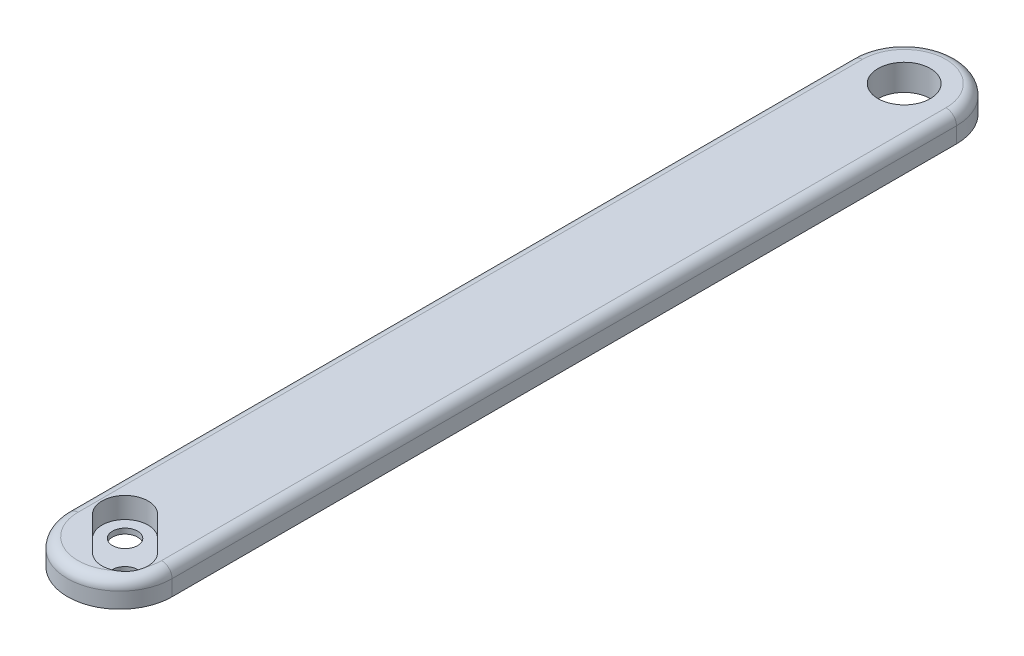
ISO-10303-21;
HEADER;
FILE_DESCRIPTION(('STEP AP214'),'2;1');
FILE_NAME('part.step','',(''),(''),'','','');
FILE_SCHEMA(('AUTOMOTIVE_DESIGN { 1 0 10303 214 1 1 1 1 }'));
ENDSEC;
DATA;
#1=APPLICATION_CONTEXT('core data for automotive mechanical design processes');
#2=APPLICATION_PROTOCOL_DEFINITION('international standard','automotive_design',2000,#1);
#3=PRODUCT_CONTEXT('',#1,'mechanical');
#4=PRODUCT('Part','Part','',(#3));
#5=PRODUCT_RELATED_PRODUCT_CATEGORY('part','',(#4));
#6=PRODUCT_DEFINITION_FORMATION('','',#4);
#7=PRODUCT_DEFINITION_CONTEXT('part definition',#1,'design');
#8=PRODUCT_DEFINITION('design','',#6,#7);
#9=PRODUCT_DEFINITION_SHAPE('','',#8);
#10=(LENGTH_UNIT() NAMED_UNIT(*) SI_UNIT(.MILLI.,.METRE.));
#11=(NAMED_UNIT(*) PLANE_ANGLE_UNIT() SI_UNIT($,.RADIAN.));
#12=(NAMED_UNIT(*) SI_UNIT($,.STERADIAN.) SOLID_ANGLE_UNIT());
#13=UNCERTAINTY_MEASURE_WITH_UNIT(LENGTH_MEASURE(1.E-05),#10,'distance_accuracy_value','');
#14=(GEOMETRIC_REPRESENTATION_CONTEXT(3) GLOBAL_UNCERTAINTY_ASSIGNED_CONTEXT((#13)) GLOBAL_UNIT_ASSIGNED_CONTEXT((#10,
#11,#12)) REPRESENTATION_CONTEXT('',''));
#15=CARTESIAN_POINT('',(0.,0.,0.));
#16=DIRECTION('',(0.,0.,1.));
#17=DIRECTION('',(1.,0.,0.));
#18=AXIS2_PLACEMENT_3D('',#15,#16,#17);
#19=CARTESIAN_POINT('',(400000.,1.50000000002137,52.9403065089141));
#20=DIRECTION('',(0.,1.,0.));
#21=DIRECTION('',(0.,0.,1.));
#22=AXIS2_PLACEMENT_3D('',#19,#20,#21);
#23=PLANE('',#22);
#24=CARTESIAN_POINT('',(0.,1.50000000002137,-37.5));
#25=DIRECTION('',(0.,1.,0.));
#26=DIRECTION('',(0.,0.,1.));
#27=AXIS2_PLACEMENT_3D('',#24,#25,#26);
#28=CIRCLE('',#27,2.5);
#29=CARTESIAN_POINT('',(0.,1.50000000002137,-35.));
#30=VERTEX_POINT('',#29);
#31=EDGE_CURVE('E179',#30,#30,#28,.T.);
#32=ORIENTED_EDGE('',*,*,#31,.T.);
#33=EDGE_LOOP('',(#32));
#34=FACE_BOUND('',#33,.T.);
#35=DIRECTION('',(0.,0.,-1.));
#36=VECTOR('',#35,1.);
#37=CARTESIAN_POINT('',(4.99999999999545,1.50000000002137,52.9403065089141));
#38=LINE('',#37,#36);
#39=CARTESIAN_POINT('',(4.99999999999999,1.5,37.5));
#40=VERTEX_POINT('',#39);
#41=CARTESIAN_POINT('',(4.99999999999545,1.50000000002137,-37.5));
#42=VERTEX_POINT('',#41);
#43=EDGE_CURVE('E65',#40,#42,#38,.T.);
#44=ORIENTED_EDGE('',*,*,#43,.F.);
#45=CARTESIAN_POINT('',(0.,1.5,37.5));
#46=DIRECTION('',(0.,1.,0.));
#47=DIRECTION('',(0.,0.,1.));
#48=AXIS2_PLACEMENT_3D('',#45,#46,#47);
#49=CIRCLE('',#48,4.99999999999998);
#50=CARTESIAN_POINT('',(-4.99999999999998,1.5,37.5));
#51=VERTEX_POINT('',#50);
#52=EDGE_CURVE('E297',#51,#40,#49,.T.);
#53=ORIENTED_EDGE('',*,*,#52,.F.);
#54=DIRECTION('',(0.,0.,-1.));
#55=VECTOR('',#54,1.);
#56=CARTESIAN_POINT('',(-4.99999999999545,1.50000000002137,52.9403065089141));
#57=LINE('',#56,#55);
#58=CARTESIAN_POINT('',(-4.99999999999545,1.50000000002137,-37.5));
#59=VERTEX_POINT('',#58);
#60=EDGE_CURVE('E58',#51,#59,#57,.T.);
#61=ORIENTED_EDGE('',*,*,#60,.T.);
#62=CARTESIAN_POINT('',(0.,1.50000000002137,-37.5));
#63=DIRECTION('',(0.,1.,0.));
#64=DIRECTION('',(0.,0.,1.));
#65=AXIS2_PLACEMENT_3D('',#62,#63,#64);
#66=CIRCLE('',#65,4.99999999999998);
#67=EDGE_CURVE('E181',#42,#59,#66,.T.);
#68=ORIENTED_EDGE('',*,*,#67,.F.);
#69=EDGE_LOOP('',(#44,#53,#61,#68));
#70=FACE_BOUND('',#69,.T.);
#71=CARTESIAN_POINT('',(-1.59099025766973,1.5,35.4090097423302));
#72=DIRECTION('',(0.,1.,0.));
#73=DIRECTION('',(0.,0.,1.));
#74=AXIS2_PLACEMENT_3D('',#71,#72,#73);
#75=CIRCLE('',#74,1.2);
#76=CARTESIAN_POINT('',(-1.59099025766973,1.5,36.6090097423302));
#77=VERTEX_POINT('',#76);
#78=EDGE_CURVE('E51',#77,#77,#75,.F.);
#79=ORIENTED_EDGE('',*,*,#78,.F.);
#80=EDGE_LOOP('',(#79));
#81=FACE_BOUND('',#80,.T.);
#82=CARTESIAN_POINT('',(1.59099025766973,1.5,38.5909902576697));
#83=DIRECTION('',(0.,1.,0.));
#84=DIRECTION('',(0.,0.,1.));
#85=AXIS2_PLACEMENT_3D('',#82,#83,#84);
#86=CIRCLE('',#85,1.2);
#87=CARTESIAN_POINT('',(1.59099025766973,1.5,39.7909902576697));
#88=VERTEX_POINT('',#87);
#89=EDGE_CURVE('E11',#88,#88,#86,.F.);
#90=ORIENTED_EDGE('',*,*,#89,.F.);
#91=EDGE_LOOP('',(#90));
#92=FACE_BOUND('',#91,.T.);
#93=ADVANCED_FACE('F42',(#34,#70,#81,#92),#23,.F.);
#94=CARTESIAN_POINT('',(-35.6943650813896,2.,-1.80563491861055));
#95=DIRECTION('',(-0.707106781186549,0.,0.707106781186546));
#96=DIRECTION('',(0.707106781186546,0.,0.707106781186549));
#97=AXIS2_PLACEMENT_3D('',#94,#95,#96);
#98=PLANE('',#97);
#99=DIRECTION('',(0.707106781186546,0.,0.707106781186549));
#100=VECTOR('',#99,1.);
#101=CARTESIAN_POINT('',(-35.6943650813896,4.,-1.80563491861055));
#102=LINE('',#101,#100);
#103=CARTESIAN_POINT('',(-0.0353553390593218,4.,33.8533748237198));
#104=VERTEX_POINT('',#103);
#105=CARTESIAN_POINT('',(3.14662517628014,4.,37.0353553390593));
#106=VERTEX_POINT('',#105);
#107=EDGE_CURVE('E161',#104,#106,#102,.T.);
#108=ORIENTED_EDGE('',*,*,#107,.F.);
#109=DIRECTION('',(0.,1.,0.));
#110=VECTOR('',#109,1.);
#111=CARTESIAN_POINT('',(-0.0353553390593144,2.,33.8533748237198));
#112=LINE('',#111,#110);
#113=CARTESIAN_POINT('',(-0.0353553390593144,2.,33.8533748237198));
#114=VERTEX_POINT('',#113);
#115=EDGE_CURVE('E135',#114,#104,#112,.T.);
#116=ORIENTED_EDGE('',*,*,#115,.F.);
#117=DIRECTION('',(0.707106781186546,0.,0.707106781186549));
#118=VECTOR('',#117,1.);
#119=CARTESIAN_POINT('',(-35.6943650813896,2.,-1.80563491861055));
#120=LINE('',#119,#118);
#121=CARTESIAN_POINT('',(3.14662517628014,2.,37.0353553390593));
#122=VERTEX_POINT('',#121);
#123=EDGE_CURVE('E129',#114,#122,#120,.T.);
#124=ORIENTED_EDGE('',*,*,#123,.T.);
#125=DIRECTION('',(0.,1.,0.));
#126=VECTOR('',#125,1.);
#127=CARTESIAN_POINT('',(3.14662517628014,2.,37.0353553390593));
#128=LINE('',#127,#126);
#129=EDGE_CURVE('E132',#122,#106,#128,.T.);
#130=ORIENTED_EDGE('',*,*,#129,.T.);
#131=EDGE_LOOP('',(#108,#116,#124,#130));
#132=FACE_BOUND('',#131,.T.);
#133=ADVANCED_FACE('F131',(#132),#98,.T.);
#134=CARTESIAN_POINT('',(-1.59099025766973,2.,35.4090097423302));
#135=DIRECTION('',(0.,1.,0.));
#136=DIRECTION('',(0.,0.,1.));
#137=AXIS2_PLACEMENT_3D('',#134,#135,#136);
#138=CYLINDRICAL_SURFACE('',#137,2.2);
#139=CARTESIAN_POINT('',(-1.59099025766973,4.,35.4090097423302));
#140=DIRECTION('',(0.,1.,0.));
#141=DIRECTION('',(0.,0.,1.));
#142=AXIS2_PLACEMENT_3D('',#139,#140,#141);
#143=CIRCLE('',#142,2.2);
#144=CARTESIAN_POINT('',(-3.14662517628013,4.,36.9646446609407));
#145=VERTEX_POINT('',#144);
#146=EDGE_CURVE('E175',#104,#145,#143,.T.);
#147=ORIENTED_EDGE('',*,*,#146,.T.);
#148=DIRECTION('',(0.,1.,0.));
#149=VECTOR('',#148,1.);
#150=CARTESIAN_POINT('',(-3.14662517628013,2.,36.9646446609407));
#151=LINE('',#150,#149);
#152=CARTESIAN_POINT('',(-3.14662517628013,2.,36.9646446609407));
#153=VERTEX_POINT('',#152);
#154=EDGE_CURVE('E169',#153,#145,#151,.T.);
#155=ORIENTED_EDGE('',*,*,#154,.F.);
#156=CARTESIAN_POINT('',(-1.59099025766973,2.,35.4090097423302));
#157=DIRECTION('',(0.,1.,0.));
#158=DIRECTION('',(0.,0.,1.));
#159=AXIS2_PLACEMENT_3D('',#156,#157,#158);
#160=CIRCLE('',#159,2.2);
#161=EDGE_CURVE('E157',#114,#153,#160,.T.);
#162=ORIENTED_EDGE('',*,*,#161,.F.);
#163=ORIENTED_EDGE('',*,*,#115,.T.);
#164=EDGE_LOOP('',(#147,#155,#162,#163));
#165=FACE_BOUND('',#164,.T.);
#166=ADVANCED_FACE('F234',(#165),#138,.F.);
#167=CARTESIAN_POINT('',(-38.8056349186104,2.,1.30563491861026));
#168=DIRECTION('',(0.707106781186549,0.,-0.707106781186546));
#169=DIRECTION('',(-0.707106781186546,0.,-0.707106781186549));
#170=AXIS2_PLACEMENT_3D('',#167,#168,#169);
#171=PLANE('',#170);
#172=DIRECTION('',(-0.707106781186546,0.,-0.707106781186549));
#173=VECTOR('',#172,1.);
#174=CARTESIAN_POINT('',(-38.8056349186104,4.,1.30563491861026));
#175=LINE('',#174,#173);
#176=CARTESIAN_POINT('',(0.0353553390593161,4.,40.1466251762801));
#177=VERTEX_POINT('',#176);
#178=EDGE_CURVE('E141',#177,#145,#175,.T.);
#179=ORIENTED_EDGE('',*,*,#178,.F.);
#180=DIRECTION('',(0.,1.,0.));
#181=VECTOR('',#180,1.);
#182=CARTESIAN_POINT('',(0.0353553390593161,2.,40.1466251762801));
#183=LINE('',#182,#181);
#184=CARTESIAN_POINT('',(0.0353553390593161,2.,40.1466251762801));
#185=VERTEX_POINT('',#184);
#186=EDGE_CURVE('E150',#185,#177,#183,.T.);
#187=ORIENTED_EDGE('',*,*,#186,.F.);
#188=DIRECTION('',(-0.707106781186546,0.,-0.707106781186549));
#189=VECTOR('',#188,1.);
#190=CARTESIAN_POINT('',(-38.8056349186104,2.,1.30563491861026));
#191=LINE('',#190,#189);
#192=EDGE_CURVE('E155',#185,#153,#191,.T.);
#193=ORIENTED_EDGE('',*,*,#192,.T.);
#194=ORIENTED_EDGE('',*,*,#154,.T.);
#195=EDGE_LOOP('',(#179,#187,#193,#194));
#196=FACE_BOUND('',#195,.T.);
#197=ADVANCED_FACE('F230',(#196),#171,.T.);
#198=CARTESIAN_POINT('',(1.59099025766973,2.,38.5909902576697));
#199=DIRECTION('',(0.,1.,0.));
#200=DIRECTION('',(0.,0.,1.));
#201=AXIS2_PLACEMENT_3D('',#198,#199,#200);
#202=CYLINDRICAL_SURFACE('',#201,2.2);
#203=CARTESIAN_POINT('',(1.59099025766973,4.,38.5909902576697));
#204=DIRECTION('',(0.,1.,0.));
#205=DIRECTION('',(0.,0.,1.));
#206=AXIS2_PLACEMENT_3D('',#203,#204,#205);
#207=CIRCLE('',#206,2.2);
#208=CARTESIAN_POINT('',(2.58169802268782,4.,40.5552962736287));
#209=VERTEX_POINT('',#208);
#210=EDGE_CURVE('E164',#177,#209,#207,.T.);
#211=ORIENTED_EDGE('',*,*,#210,.T.);
#212=CARTESIAN_POINT('',(2.58169802268782,4.,40.5552962736287));
#213=CARTESIAN_POINT('',(2.63689183740544,3.99999159626086,40.5274656465535));
#214=CARTESIAN_POINT('',(2.69090327050049,3.99969050898031,40.4973003692301));
#215=CARTESIAN_POINT('',(2.79619330700551,3.99874624990308,40.4325381931477));
#216=CARTESIAN_POINT('',(2.84747207442742,3.99810309866225,40.3979415607794));
#217=CARTESIAN_POINT('',(2.94686026907065,3.99671898152754,40.3246064138783));
#218=CARTESIAN_POINT('',(2.99497436930376,3.99597816494018,40.2858742384285));
#219=CARTESIAN_POINT('',(3.08776875404367,3.99457563468766,40.2045162109842));
#220=CARTESIAN_POINT('',(3.13244908076547,3.99391392004995,40.1618904068722));
#221=CARTESIAN_POINT('',(3.26099220874909,3.99226245439816,40.0284644930363));
#222=CARTESIAN_POINT('',(3.33928322705264,3.99160784773623,39.9321705310243));
#223=CARTESIAN_POINT('',(3.47856949250349,3.99165080628025,39.7277997572248));
#224=CARTESIAN_POINT('',(3.53956541317033,3.99234831882259,39.6197234045035));
#225=CARTESIAN_POINT('',(3.61631302097894,3.99403229212766,39.4522466884963));
#226=CARTESIAN_POINT('',(3.63929494649869,3.99469119190382,39.396056907531));
#227=CARTESIAN_POINT('',(3.68054491834109,3.99607743250649,39.2819583680319));
#228=CARTESIAN_POINT('',(3.69881298820422,3.99680477299121,39.2240496180839));
#229=CARTESIAN_POINT('',(3.73052034716171,3.99815807772737,39.1068408280111));
#230=CARTESIAN_POINT('',(3.74395289067171,3.99878389969694,39.0475389663114));
#231=CARTESIAN_POINT('',(3.76587132181636,3.99970095443944,38.9280213710737));
#232=CARTESIAN_POINT('',(3.77435685141511,3.9999921629965,38.8678055717138));
#233=CARTESIAN_POINT('',(3.78032670887704,4.,38.80733697804));
#234=B_SPLINE_CURVE_WITH_KNOTS('',3,(#212,#213,#214,#215,#216,#217,#218,#219,#220,#221,#222,
#223,#224,#225,#226,#227,#228,#229,#230,#231,#232,#233),.UNSPECIFIED.,.F.,.F.,(4,2,2,2,2,2,2,2,
2,2,4),(0.,0.18537747485937,0.370743810981603,0.555829983891321,0.740913880977977,
1.11135401447838,1.48177972002065,1.66374251795893,1.84570440717749,2.0279191594073,
2.21014709763721),.UNSPECIFIED.);
#235=CARTESIAN_POINT('',(3.78032670887704,4.,38.80733697804));
#236=VERTEX_POINT('',#235);
#237=EDGE_CURVE('E216',#209,#236,#234,.T.);
#238=ORIENTED_EDGE('',*,*,#237,.T.);
#239=EDGE_CURVE('E148',#236,#106,#207,.T.);
#240=ORIENTED_EDGE('',*,*,#239,.T.);
#241=ORIENTED_EDGE('',*,*,#129,.F.);
#242=CARTESIAN_POINT('',(1.59099025766973,2.,38.5909902576697));
#243=DIRECTION('',(0.,1.,0.));
#244=DIRECTION('',(0.,0.,1.));
#245=AXIS2_PLACEMENT_3D('',#242,#243,#244);
#246=CIRCLE('',#245,2.2);
#247=EDGE_CURVE('E140',#185,#122,#246,.T.);
#248=ORIENTED_EDGE('',*,*,#247,.F.);
#249=ORIENTED_EDGE('',*,*,#186,.T.);
#250=EDGE_LOOP('',(#211,#238,#240,#241,#248,#249));
#251=FACE_BOUND('',#250,.T.);
#252=ADVANCED_FACE('F146',(#251),#202,.F.);
#253=CARTESIAN_POINT('',(0.,4.,-37.5));
#254=DIRECTION('',(0.,1.,0.));
#255=DIRECTION('',(0.,0.,1.));
#256=AXIS2_PLACEMENT_3D('',#253,#254,#255);
#257=PLANE('',#256);
#258=ORIENTED_EDGE('',*,*,#239,.F.);
#259=CARTESIAN_POINT('',(0.,4.,37.5));
#260=DIRECTION('',(0.,1.,0.));
#261=DIRECTION('',(0.,0.,1.));
#262=AXIS2_PLACEMENT_3D('',#259,#260,#261);
#263=CIRCLE('',#262,3.99999999999998);
#264=CARTESIAN_POINT('',(3.99999999999999,4.,37.5));
#265=VERTEX_POINT('',#264);
#266=EDGE_CURVE('E209',#236,#265,#263,.T.);
#267=ORIENTED_EDGE('',*,*,#266,.T.);
#268=DIRECTION('',(0.,0.,-1.));
#269=VECTOR('',#268,1.);
#270=CARTESIAN_POINT('',(3.99999999999997,4.,-37.5));
#271=LINE('',#270,#269);
#272=CARTESIAN_POINT('',(3.99999999999997,4.,-37.5));
#273=VERTEX_POINT('',#272);
#274=EDGE_CURVE('E207',#265,#273,#271,.T.);
#275=ORIENTED_EDGE('',*,*,#274,.T.);
#276=CARTESIAN_POINT('',(0.,4.,-37.5));
#277=DIRECTION('',(0.,1.,0.));
#278=DIRECTION('',(0.,0.,1.));
#279=AXIS2_PLACEMENT_3D('',#276,#277,#278);
#280=CIRCLE('',#279,3.99999999999998);
#281=CARTESIAN_POINT('',(-4.,4.,-37.5));
#282=VERTEX_POINT('',#281);
#283=EDGE_CURVE('E204',#273,#282,#280,.T.);
#284=ORIENTED_EDGE('',*,*,#283,.T.);
#285=DIRECTION('',(0.,0.,1.));
#286=VECTOR('',#285,1.);
#287=CARTESIAN_POINT('',(-3.99999999999998,4.,37.5));
#288=LINE('',#287,#286);
#289=CARTESIAN_POINT('',(-3.99999999999998,4.,37.5));
#290=VERTEX_POINT('',#289);
#291=EDGE_CURVE('E196',#282,#290,#288,.T.);
#292=ORIENTED_EDGE('',*,*,#291,.T.);
#293=CARTESIAN_POINT('',(0.,4.,37.5));
#294=DIRECTION('',(0.,1.,0.));
#295=DIRECTION('',(0.,0.,1.));
#296=AXIS2_PLACEMENT_3D('',#293,#294,#295);
#297=CIRCLE('',#296,3.99999999999998);
#298=EDGE_CURVE('E202',#290,#209,#297,.T.);
#299=ORIENTED_EDGE('',*,*,#298,.T.);
#300=ORIENTED_EDGE('',*,*,#210,.F.);
#301=ORIENTED_EDGE('',*,*,#178,.T.);
#302=ORIENTED_EDGE('',*,*,#146,.F.);
#303=ORIENTED_EDGE('',*,*,#107,.T.);
#304=EDGE_LOOP('',(#258,#267,#275,#284,#292,#299,#300,#301,#302,#303));
#305=FACE_BOUND('',#304,.T.);
#306=CARTESIAN_POINT('',(0.,4.,-37.5));
#307=DIRECTION('',(0.,1.,0.));
#308=DIRECTION('',(0.,0.,1.));
#309=AXIS2_PLACEMENT_3D('',#306,#307,#308);
#310=CIRCLE('',#309,2.5);
#311=CARTESIAN_POINT('',(0.,4.,-35.));
#312=VERTEX_POINT('',#311);
#313=EDGE_CURVE('E183',#312,#312,#310,.T.);
#314=ORIENTED_EDGE('',*,*,#313,.F.);
#315=EDGE_LOOP('',(#314));
#316=FACE_BOUND('',#315,.T.);
#317=ADVANCED_FACE('F229',(#305,#316),#257,.T.);
#318=CARTESIAN_POINT('',(0.,4.,-37.5));
#319=DIRECTION('',(0.,-1.,0.));
#320=DIRECTION('',(0.,0.,-1.));
#321=AXIS2_PLACEMENT_3D('',#318,#319,#320);
#322=CYLINDRICAL_SURFACE('',#321,2.5);
#323=ORIENTED_EDGE('',*,*,#31,.F.);
#324=EDGE_LOOP('',(#323));
#325=FACE_BOUND('',#324,.T.);
#326=ORIENTED_EDGE('',*,*,#313,.T.);
#327=EDGE_LOOP('',(#326));
#328=FACE_BOUND('',#327,.T.);
#329=ADVANCED_FACE('F246',(#325,#328),#322,.F.);
#330=CARTESIAN_POINT('',(0.,3.,37.5));
#331=DIRECTION('',(0.,1.,0.));
#332=DIRECTION('',(0.,0.,1.));
#333=AXIS2_PLACEMENT_3D('',#330,#331,#332);
#334=TOROIDAL_SURFACE('',#333,3.99999999999998,1.);
#335=CARTESIAN_POINT('',(-3.99999999999998,3.,37.5));
#336=DIRECTION('',(0.,0.,-1.));
#337=DIRECTION('',(-1.,0.,0.));
#338=AXIS2_PLACEMENT_3D('',#335,#336,#337);
#339=CIRCLE('',#338,1.);
#340=CARTESIAN_POINT('',(-4.99999999999998,3.,37.5));
#341=VERTEX_POINT('',#340);
#342=EDGE_CURVE('E290',#341,#290,#339,.T.);
#343=ORIENTED_EDGE('',*,*,#342,.F.);
#344=CARTESIAN_POINT('',(0.,3.,37.5));
#345=DIRECTION('',(0.,1.,0.));
#346=DIRECTION('',(0.,0.,1.));
#347=AXIS2_PLACEMENT_3D('',#344,#345,#346);
#348=CIRCLE('',#347,4.99999999999998);
#349=CARTESIAN_POINT('',(4.99999999999999,3.,37.5));
#350=VERTEX_POINT('',#349);
#351=EDGE_CURVE('E223',#350,#341,#348,.F.);
#352=ORIENTED_EDGE('',*,*,#351,.F.);
#353=CARTESIAN_POINT('',(3.99999999999999,3.,37.5));
#354=DIRECTION('',(0.,0.,-1.));
#355=DIRECTION('',(-1.,0.,0.));
#356=AXIS2_PLACEMENT_3D('',#353,#354,#355);
#357=CIRCLE('',#356,1.);
#358=EDGE_CURVE('E163',#265,#350,#357,.T.);
#359=ORIENTED_EDGE('',*,*,#358,.F.);
#360=ORIENTED_EDGE('',*,*,#266,.F.);
#361=ORIENTED_EDGE('',*,*,#237,.F.);
#362=ORIENTED_EDGE('',*,*,#298,.F.);
#363=EDGE_LOOP('',(#343,#352,#359,#360,#361,#362));
#364=FACE_BOUND('',#363,.T.);
#365=ADVANCED_FACE('F44',(#364),#334,.T.);
#366=CARTESIAN_POINT('',(0.,3.,-37.5));
#367=DIRECTION('',(0.,1.,0.));
#368=DIRECTION('',(0.,0.,1.));
#369=AXIS2_PLACEMENT_3D('',#366,#367,#368);
#370=TOROIDAL_SURFACE('',#369,3.99999999999998,1.);
#371=CARTESIAN_POINT('',(3.99999999999997,3.,-37.5));
#372=DIRECTION('',(0.,0.,-1.));
#373=DIRECTION('',(-1.,0.,0.));
#374=AXIS2_PLACEMENT_3D('',#371,#372,#373);
#375=CIRCLE('',#374,1.);
#376=CARTESIAN_POINT('',(4.99999999999997,3.,-37.5));
#377=VERTEX_POINT('',#376);
#378=EDGE_CURVE('E293',#273,#377,#375,.T.);
#379=ORIENTED_EDGE('',*,*,#378,.T.);
#380=CARTESIAN_POINT('',(0.,3.,-37.5));
#381=DIRECTION('',(0.,1.,0.));
#382=DIRECTION('',(0.,0.,1.));
#383=AXIS2_PLACEMENT_3D('',#380,#381,#382);
#384=CIRCLE('',#383,4.99999999999998);
#385=CARTESIAN_POINT('',(-5.,3.,-37.5));
#386=VERTEX_POINT('',#385);
#387=EDGE_CURVE('E211',#386,#377,#384,.F.);
#388=ORIENTED_EDGE('',*,*,#387,.F.);
#389=CARTESIAN_POINT('',(-4.,3.,-37.5));
#390=DIRECTION('',(0.,0.,-1.));
#391=DIRECTION('',(-1.,0.,0.));
#392=AXIS2_PLACEMENT_3D('',#389,#390,#391);
#393=CIRCLE('',#392,1.);
#394=EDGE_CURVE('E332',#386,#282,#393,.T.);
#395=ORIENTED_EDGE('',*,*,#394,.T.);
#396=ORIENTED_EDGE('',*,*,#283,.F.);
#397=EDGE_LOOP('',(#379,#388,#395,#396));
#398=FACE_BOUND('',#397,.T.);
#399=ADVANCED_FACE('F270',(#398),#370,.T.);
#400=CARTESIAN_POINT('',(3.99999999999997,3.,-37.5));
#401=DIRECTION('',(0.,0.,1.));
#402=DIRECTION('',(1.,0.,0.));
#403=AXIS2_PLACEMENT_3D('',#400,#401,#402);
#404=CYLINDRICAL_SURFACE('',#403,1.);
#405=ORIENTED_EDGE('',*,*,#358,.T.);
#406=DIRECTION('',(0.,0.,-1.));
#407=VECTOR('',#406,1.);
#408=CARTESIAN_POINT('',(4.99999999999999,3.,37.5));
#409=LINE('',#408,#407);
#410=EDGE_CURVE('E214',#377,#350,#409,.F.);
#411=ORIENTED_EDGE('',*,*,#410,.F.);
#412=ORIENTED_EDGE('',*,*,#378,.F.);
#413=ORIENTED_EDGE('',*,*,#274,.F.);
#414=EDGE_LOOP('',(#405,#411,#412,#413));
#415=FACE_BOUND('',#414,.T.);
#416=ADVANCED_FACE('F268',(#415),#404,.T.);
#417=CARTESIAN_POINT('',(0.,4.,-37.5));
#418=DIRECTION('',(0.,-1.,0.));
#419=DIRECTION('',(0.,0.,-1.));
#420=AXIS2_PLACEMENT_3D('',#417,#418,#419);
#421=CYLINDRICAL_SURFACE('',#420,4.99999999999998);
#422=DIRECTION('',(0.,-1.,0.));
#423=VECTOR('',#422,1.);
#424=CARTESIAN_POINT('',(-5.,4.,-37.5));
#425=LINE('',#424,#423);
#426=EDGE_CURVE('E194',#386,#59,#425,.T.);
#427=ORIENTED_EDGE('',*,*,#426,.F.);
#428=ORIENTED_EDGE('',*,*,#387,.T.);
#429=DIRECTION('',(0.,-1.,0.));
#430=VECTOR('',#429,1.);
#431=CARTESIAN_POINT('',(4.99999999999997,4.,-37.5));
#432=LINE('',#431,#430);
#433=EDGE_CURVE('E186',#377,#42,#432,.T.);
#434=ORIENTED_EDGE('',*,*,#433,.T.);
#435=ORIENTED_EDGE('',*,*,#67,.T.);
#436=EDGE_LOOP('',(#427,#428,#434,#435));
#437=FACE_BOUND('',#436,.T.);
#438=ADVANCED_FACE('F265',(#437),#421,.T.);
#439=CARTESIAN_POINT('',(-4.,3.,-37.5));
#440=DIRECTION('',(0.,0.,-1.));
#441=DIRECTION('',(-1.,0.,0.));
#442=AXIS2_PLACEMENT_3D('',#439,#440,#441);
#443=CYLINDRICAL_SURFACE('',#442,1.);
#444=ORIENTED_EDGE('',*,*,#342,.T.);
#445=ORIENTED_EDGE('',*,*,#291,.F.);
#446=ORIENTED_EDGE('',*,*,#394,.F.);
#447=DIRECTION('',(0.,0.,1.));
#448=VECTOR('',#447,1.);
#449=CARTESIAN_POINT('',(-5.,3.,-37.5));
#450=LINE('',#449,#448);
#451=EDGE_CURVE('E298',#341,#386,#450,.F.);
#452=ORIENTED_EDGE('',*,*,#451,.F.);
#453=EDGE_LOOP('',(#444,#445,#446,#452));
#454=FACE_BOUND('',#453,.T.);
#455=ADVANCED_FACE('F261',(#454),#443,.T.);
#456=CARTESIAN_POINT('',(0.,4.,37.5));
#457=DIRECTION('',(0.,-1.,0.));
#458=DIRECTION('',(0.,0.,-1.));
#459=AXIS2_PLACEMENT_3D('',#456,#457,#458);
#460=CYLINDRICAL_SURFACE('',#459,4.99999999999998);
#461=ORIENTED_EDGE('',*,*,#52,.T.);
#462=DIRECTION('',(0.,-1.,0.));
#463=VECTOR('',#462,1.);
#464=CARTESIAN_POINT('',(4.99999999999999,4.,37.5));
#465=LINE('',#464,#463);
#466=EDGE_CURVE('E188',#350,#40,#465,.T.);
#467=ORIENTED_EDGE('',*,*,#466,.F.);
#468=ORIENTED_EDGE('',*,*,#351,.T.);
#469=DIRECTION('',(0.,-1.,0.));
#470=VECTOR('',#469,1.);
#471=CARTESIAN_POINT('',(-4.99999999999998,4.,37.5));
#472=LINE('',#471,#470);
#473=EDGE_CURVE('E191',#341,#51,#472,.T.);
#474=ORIENTED_EDGE('',*,*,#473,.T.);
#475=EDGE_LOOP('',(#461,#467,#468,#474));
#476=FACE_BOUND('',#475,.T.);
#477=ADVANCED_FACE('F258',(#476),#460,.T.);
#478=CARTESIAN_POINT('',(-5.,4.,-37.5));
#479=DIRECTION('',(1.,0.,0.));
#480=DIRECTION('',(0.,0.,-1.));
#481=AXIS2_PLACEMENT_3D('',#478,#479,#480);
#482=PLANE('',#481);
#483=ORIENTED_EDGE('',*,*,#60,.F.);
#484=ORIENTED_EDGE('',*,*,#473,.F.);
#485=ORIENTED_EDGE('',*,*,#451,.T.);
#486=ORIENTED_EDGE('',*,*,#426,.T.);
#487=EDGE_LOOP('',(#483,#484,#485,#486));
#488=FACE_BOUND('',#487,.T.);
#489=ADVANCED_FACE('F256',(#488),#482,.F.);
#490=CARTESIAN_POINT('',(4.99999999999997,4.,-37.5));
#491=DIRECTION('',(-1.,0.,0.));
#492=DIRECTION('',(0.,0.,1.));
#493=AXIS2_PLACEMENT_3D('',#490,#491,#492);
#494=PLANE('',#493);
#495=ORIENTED_EDGE('',*,*,#466,.T.);
#496=ORIENTED_EDGE('',*,*,#43,.T.);
#497=ORIENTED_EDGE('',*,*,#433,.F.);
#498=ORIENTED_EDGE('',*,*,#410,.T.);
#499=EDGE_LOOP('',(#495,#496,#497,#498));
#500=FACE_BOUND('',#499,.T.);
#501=ADVANCED_FACE('F253',(#500),#494,.F.);
#502=CARTESIAN_POINT('',(1.59099025766973,2.,38.5909902576697));
#503=DIRECTION('',(0.,1.,0.));
#504=DIRECTION('',(0.,0.,1.));
#505=AXIS2_PLACEMENT_3D('',#502,#503,#504);
#506=PLANE('',#505);
#507=ORIENTED_EDGE('',*,*,#123,.F.);
#508=ORIENTED_EDGE('',*,*,#161,.T.);
#509=ORIENTED_EDGE('',*,*,#192,.F.);
#510=ORIENTED_EDGE('',*,*,#247,.T.);
#511=EDGE_LOOP('',(#507,#508,#509,#510));
#512=FACE_BOUND('',#511,.T.);
#513=CARTESIAN_POINT('',(-1.59099025766973,2.,35.4090097423302));
#514=DIRECTION('',(0.,1.,0.));
#515=DIRECTION('',(0.,0.,1.));
#516=AXIS2_PLACEMENT_3D('',#513,#514,#515);
#517=CIRCLE('',#516,1.2);
#518=CARTESIAN_POINT('',(-1.59099025766973,2.,36.6090097423302));
#519=VERTEX_POINT('',#518);
#520=EDGE_CURVE('E149',#519,#519,#517,.F.);
#521=ORIENTED_EDGE('',*,*,#520,.T.);
#522=EDGE_LOOP('',(#521));
#523=FACE_BOUND('',#522,.T.);
#524=CARTESIAN_POINT('',(1.59099025766973,2.,38.5909902576697));
#525=DIRECTION('',(0.,1.,0.));
#526=DIRECTION('',(0.,0.,1.));
#527=AXIS2_PLACEMENT_3D('',#524,#525,#526);
#528=CIRCLE('',#527,1.2);
#529=CARTESIAN_POINT('',(1.59099025766973,2.,39.7909902576697));
#530=VERTEX_POINT('',#529);
#531=EDGE_CURVE('E172',#530,#530,#528,.F.);
#532=ORIENTED_EDGE('',*,*,#531,.T.);
#533=EDGE_LOOP('',(#532));
#534=FACE_BOUND('',#533,.T.);
#535=ADVANCED_FACE('F153',(#512,#523,#534),#506,.T.);
#536=CARTESIAN_POINT('',(-1.59099025766973,4.,35.4090097423302));
#537=DIRECTION('',(0.,1.,0.));
#538=DIRECTION('',(0.,0.,1.));
#539=AXIS2_PLACEMENT_3D('',#536,#537,#538);
#540=CYLINDRICAL_SURFACE('',#539,1.2);
#541=ORIENTED_EDGE('',*,*,#78,.T.);
#542=EDGE_LOOP('',(#541));
#543=FACE_BOUND('',#542,.T.);
#544=ORIENTED_EDGE('',*,*,#520,.F.);
#545=EDGE_LOOP('',(#544));
#546=FACE_BOUND('',#545,.T.);
#547=ADVANCED_FACE('F235',(#543,#546),#540,.F.);
#548=CARTESIAN_POINT('',(1.59099025766973,4.,38.5909902576697));
#549=DIRECTION('',(0.,1.,0.));
#550=DIRECTION('',(0.,0.,1.));
#551=AXIS2_PLACEMENT_3D('',#548,#549,#550);
#552=CYLINDRICAL_SURFACE('',#551,1.2);
#553=ORIENTED_EDGE('',*,*,#89,.T.);
#554=EDGE_LOOP('',(#553));
#555=FACE_BOUND('',#554,.T.);
#556=ORIENTED_EDGE('',*,*,#531,.F.);
#557=EDGE_LOOP('',(#556));
#558=FACE_BOUND('',#557,.T.);
#559=ADVANCED_FACE('F238',(#555,#558),#552,.F.);
#560=CLOSED_SHELL('',(#93,#133,#166,#197,#252,#317,#329,#365,#399,#416,#438,#455,#477,#489,#501,
#535,#547,#559));
#561=MANIFOLD_SOLID_BREP('B2',#560);
#562=ADVANCED_BREP_SHAPE_REPRESENTATION('',(#18,#561),#14);
#563=SHAPE_DEFINITION_REPRESENTATION(#9,#562);
ENDSEC;
END-ISO-10303-21;
